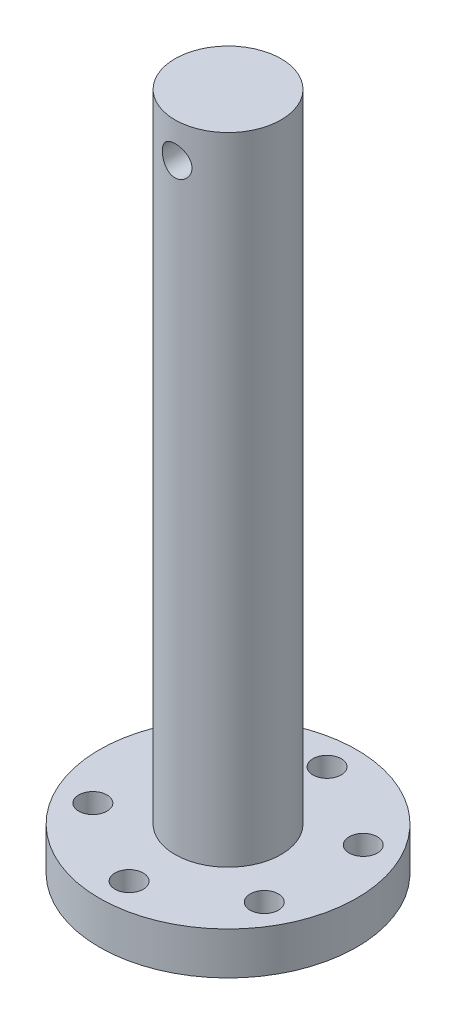
ISO-10303-21;
HEADER;
FILE_DESCRIPTION(('STEP AP214'),'2;1');
FILE_NAME('part.step','',(''),(''),'','','');
FILE_SCHEMA(('AUTOMOTIVE_DESIGN { 1 0 10303 214 1 1 1 1 }'));
ENDSEC;
DATA;
#1=APPLICATION_CONTEXT('core data for automotive mechanical design processes');
#2=APPLICATION_PROTOCOL_DEFINITION('international standard','automotive_design',2000,#1);
#3=PRODUCT_CONTEXT('',#1,'mechanical');
#4=PRODUCT('Part','Part','',(#3));
#5=PRODUCT_RELATED_PRODUCT_CATEGORY('part','',(#4));
#6=PRODUCT_DEFINITION_FORMATION('','',#4);
#7=PRODUCT_DEFINITION_CONTEXT('part definition',#1,'design');
#8=PRODUCT_DEFINITION('design','',#6,#7);
#9=PRODUCT_DEFINITION_SHAPE('','',#8);
#10=(LENGTH_UNIT() NAMED_UNIT(*) SI_UNIT(.MILLI.,.METRE.));
#11=(NAMED_UNIT(*) PLANE_ANGLE_UNIT() SI_UNIT($,.RADIAN.));
#12=(NAMED_UNIT(*) SI_UNIT($,.STERADIAN.) SOLID_ANGLE_UNIT());
#13=UNCERTAINTY_MEASURE_WITH_UNIT(LENGTH_MEASURE(1.E-05),#10,'distance_accuracy_value','');
#14=(GEOMETRIC_REPRESENTATION_CONTEXT(3) GLOBAL_UNCERTAINTY_ASSIGNED_CONTEXT((#13)) GLOBAL_UNIT_ASSIGNED_CONTEXT((#10,
#11,#12)) REPRESENTATION_CONTEXT('',''));
#15=CARTESIAN_POINT('',(0.,0.,0.));
#16=DIRECTION('',(0.,0.,1.));
#17=DIRECTION('',(1.,0.,0.));
#18=AXIS2_PLACEMENT_3D('',#15,#16,#17);
#19=CARTESIAN_POINT('',(0.,6.,0.));
#20=DIRECTION('',(0.,-1.,0.));
#21=DIRECTION('',(0.,0.,-1.));
#22=AXIS2_PLACEMENT_3D('',#19,#20,#21);
#23=CYLINDRICAL_SURFACE('',#22,18.2);
#24=CARTESIAN_POINT('',(0.,6.,0.));
#25=DIRECTION('',(0.,1.,0.));
#26=DIRECTION('',(0.,0.,1.));
#27=AXIS2_PLACEMENT_3D('',#24,#25,#26);
#28=CIRCLE('',#27,18.2);
#29=CARTESIAN_POINT('',(0.,6.,18.2));
#30=VERTEX_POINT('',#29);
#31=EDGE_CURVE('E44',#30,#30,#28,.T.);
#32=ORIENTED_EDGE('',*,*,#31,.F.);
#33=EDGE_LOOP('',(#32));
#34=FACE_BOUND('',#33,.T.);
#35=CARTESIAN_POINT('',(0.,0.,0.));
#36=DIRECTION('',(0.,1.,0.));
#37=DIRECTION('',(0.,0.,1.));
#38=AXIS2_PLACEMENT_3D('',#35,#36,#37);
#39=CIRCLE('',#38,18.2);
#40=CARTESIAN_POINT('',(0.,0.,18.2));
#41=VERTEX_POINT('',#40);
#42=EDGE_CURVE('E48',#41,#41,#39,.T.);
#43=ORIENTED_EDGE('',*,*,#42,.T.);
#44=EDGE_LOOP('',(#43));
#45=FACE_BOUND('',#44,.T.);
#46=ADVANCED_FACE('F32',(#34,#45),#23,.T.);
#47=CARTESIAN_POINT('',(0.,6.,0.));
#48=DIRECTION('',(0.,1.,0.));
#49=DIRECTION('',(0.,0.,1.));
#50=AXIS2_PLACEMENT_3D('',#47,#48,#49);
#51=PLANE('',#50);
#52=CARTESIAN_POINT('',(0.,6.,0.));
#53=DIRECTION('',(0.,1.,0.));
#54=DIRECTION('',(0.,0.,1.));
#55=AXIS2_PLACEMENT_3D('',#52,#53,#54);
#56=CIRCLE('',#55,7.5);
#57=CARTESIAN_POINT('',(0.,6.,7.5));
#58=VERTEX_POINT('',#57);
#59=EDGE_CURVE('E130',#58,#58,#56,.T.);
#60=ORIENTED_EDGE('',*,*,#59,.F.);
#61=EDGE_LOOP('',(#60));
#62=FACE_BOUND('',#61,.T.);
#63=CARTESIAN_POINT('',(12.1243556529821,6.,-7.00000000000014));
#64=DIRECTION('',(0.,1.,0.));
#65=DIRECTION('',(-0.866025403784433,0.,0.50000000000001));
#66=AXIS2_PLACEMENT_3D('',#63,#64,#65);
#67=CIRCLE('',#66,2.);
#68=CARTESIAN_POINT('',(10.3923048454132,6.,-6.00000000000012));
#69=VERTEX_POINT('',#68);
#70=EDGE_CURVE('E118',#69,#69,#67,.T.);
#71=ORIENTED_EDGE('',*,*,#70,.F.);
#72=EDGE_LOOP('',(#71));
#73=FACE_BOUND('',#72,.T.);
#74=CARTESIAN_POINT('',(12.1243556529822,6.,6.99999999999989));
#75=DIRECTION('',(0.,1.,0.));
#76=DIRECTION('',(-0.866025403784443,0.,-0.499999999999992));
#77=AXIS2_PLACEMENT_3D('',#74,#75,#76);
#78=CIRCLE('',#77,2.);
#79=CARTESIAN_POINT('',(10.3923048454133,6.,5.9999999999999));
#80=VERTEX_POINT('',#79);
#81=EDGE_CURVE('E121',#80,#80,#78,.T.);
#82=ORIENTED_EDGE('',*,*,#81,.F.);
#83=EDGE_LOOP('',(#82));
#84=FACE_BOUND('',#83,.T.);
#85=CARTESIAN_POINT('',(0.,6.,14.));
#86=DIRECTION('',(0.,1.,0.));
#87=DIRECTION('',(0.,0.,-1.));
#88=AXIS2_PLACEMENT_3D('',#85,#86,#87);
#89=CIRCLE('',#88,2.);
#90=CARTESIAN_POINT('',(0.,6.,12.));
#91=VERTEX_POINT('',#90);
#92=EDGE_CURVE('E125',#91,#91,#89,.T.);
#93=ORIENTED_EDGE('',*,*,#92,.F.);
#94=EDGE_LOOP('',(#93));
#95=FACE_BOUND('',#94,.T.);
#96=CARTESIAN_POINT('',(-12.1243556529821,6.,7.00000000000006));
#97=DIRECTION('',(0.,1.,0.));
#98=DIRECTION('',(0.866025403784436,0.,-0.500000000000004));
#99=AXIS2_PLACEMENT_3D('',#96,#97,#98);
#100=CIRCLE('',#99,2.);
#101=CARTESIAN_POINT('',(-10.3923048454132,6.,6.00000000000005));
#102=VERTEX_POINT('',#101);
#103=EDGE_CURVE('E117',#102,#102,#100,.T.);
#104=ORIENTED_EDGE('',*,*,#103,.F.);
#105=EDGE_LOOP('',(#104));
#106=FACE_BOUND('',#105,.T.);
#107=CARTESIAN_POINT('',(-12.1243556529822,6.,-6.99999999999997));
#108=DIRECTION('',(0.,1.,0.));
#109=DIRECTION('',(0.86602540378444,0.,0.499999999999998));
#110=AXIS2_PLACEMENT_3D('',#107,#108,#109);
#111=CIRCLE('',#110,2.);
#112=CARTESIAN_POINT('',(-10.3923048454133,6.,-5.99999999999998));
#113=VERTEX_POINT('',#112);
#114=EDGE_CURVE('E99',#113,#113,#111,.T.);
#115=ORIENTED_EDGE('',*,*,#114,.F.);
#116=EDGE_LOOP('',(#115));
#117=FACE_BOUND('',#116,.T.);
#118=CARTESIAN_POINT('',(0.,6.,-14.));
#119=DIRECTION('',(0.,1.,0.));
#120=DIRECTION('',(0.,0.,1.));
#121=AXIS2_PLACEMENT_3D('',#118,#119,#120);
#122=CIRCLE('',#121,2.);
#123=CARTESIAN_POINT('',(0.,6.,-12.));
#124=VERTEX_POINT('',#123);
#125=EDGE_CURVE('E91',#124,#124,#122,.T.);
#126=ORIENTED_EDGE('',*,*,#125,.F.);
#127=EDGE_LOOP('',(#126));
#128=FACE_BOUND('',#127,.T.);
#129=ORIENTED_EDGE('',*,*,#31,.T.);
#130=EDGE_LOOP('',(#129));
#131=FACE_BOUND('',#130,.T.);
#132=ADVANCED_FACE('F75',(#62,#73,#84,#95,#106,#117,#128,#131),#51,.T.);
#133=CARTESIAN_POINT('',(0.,0.,0.));
#134=DIRECTION('',(0.,1.,0.));
#135=DIRECTION('',(0.,0.,1.));
#136=AXIS2_PLACEMENT_3D('',#133,#134,#135);
#137=PLANE('',#136);
#138=CARTESIAN_POINT('',(12.1243556529821,0.,-7.00000000000014));
#139=DIRECTION('',(0.,1.,0.));
#140=DIRECTION('',(0.,0.,1.));
#141=AXIS2_PLACEMENT_3D('',#138,#139,#140);
#142=CIRCLE('',#141,2.);
#143=CARTESIAN_POINT('',(12.1243556529821,0.,-5.00000000000014));
#144=VERTEX_POINT('',#143);
#145=EDGE_CURVE('E54',#144,#144,#142,.T.);
#146=ORIENTED_EDGE('',*,*,#145,.T.);
#147=EDGE_LOOP('',(#146));
#148=FACE_BOUND('',#147,.T.);
#149=CARTESIAN_POINT('',(12.1243556529822,0.,6.99999999999989));
#150=DIRECTION('',(0.,1.,0.));
#151=DIRECTION('',(0.,0.,1.));
#152=AXIS2_PLACEMENT_3D('',#149,#150,#151);
#153=CIRCLE('',#152,2.);
#154=CARTESIAN_POINT('',(12.1243556529822,0.,8.99999999999989));
#155=VERTEX_POINT('',#154);
#156=EDGE_CURVE('E104',#155,#155,#153,.T.);
#157=ORIENTED_EDGE('',*,*,#156,.T.);
#158=EDGE_LOOP('',(#157));
#159=FACE_BOUND('',#158,.T.);
#160=CARTESIAN_POINT('',(0.,0.,14.));
#161=DIRECTION('',(0.,1.,0.));
#162=DIRECTION('',(0.,0.,1.));
#163=AXIS2_PLACEMENT_3D('',#160,#161,#162);
#164=CIRCLE('',#163,2.);
#165=CARTESIAN_POINT('',(0.,0.,16.));
#166=VERTEX_POINT('',#165);
#167=EDGE_CURVE('E102',#166,#166,#164,.T.);
#168=ORIENTED_EDGE('',*,*,#167,.T.);
#169=EDGE_LOOP('',(#168));
#170=FACE_BOUND('',#169,.T.);
#171=CARTESIAN_POINT('',(-12.1243556529821,0.,7.00000000000006));
#172=DIRECTION('',(0.,1.,0.));
#173=DIRECTION('',(0.,0.,1.));
#174=AXIS2_PLACEMENT_3D('',#171,#172,#173);
#175=CIRCLE('',#174,2.);
#176=CARTESIAN_POINT('',(-12.1243556529821,0.,9.00000000000006));
#177=VERTEX_POINT('',#176);
#178=EDGE_CURVE('E98',#177,#177,#175,.T.);
#179=ORIENTED_EDGE('',*,*,#178,.T.);
#180=EDGE_LOOP('',(#179));
#181=FACE_BOUND('',#180,.T.);
#182=CARTESIAN_POINT('',(-12.1243556529822,0.,-6.99999999999997));
#183=DIRECTION('',(0.,1.,0.));
#184=DIRECTION('',(0.,0.,1.));
#185=AXIS2_PLACEMENT_3D('',#182,#183,#184);
#186=CIRCLE('',#185,2.);
#187=CARTESIAN_POINT('',(-12.1243556529822,0.,-4.99999999999997));
#188=VERTEX_POINT('',#187);
#189=EDGE_CURVE('E95',#188,#188,#186,.T.);
#190=ORIENTED_EDGE('',*,*,#189,.T.);
#191=EDGE_LOOP('',(#190));
#192=FACE_BOUND('',#191,.T.);
#193=CARTESIAN_POINT('',(0.,0.,-14.));
#194=DIRECTION('',(0.,1.,0.));
#195=DIRECTION('',(0.,0.,1.));
#196=AXIS2_PLACEMENT_3D('',#193,#194,#195);
#197=CIRCLE('',#196,2.);
#198=CARTESIAN_POINT('',(0.,0.,-12.));
#199=VERTEX_POINT('',#198);
#200=EDGE_CURVE('E88',#199,#199,#197,.T.);
#201=ORIENTED_EDGE('',*,*,#200,.T.);
#202=EDGE_LOOP('',(#201));
#203=FACE_BOUND('',#202,.T.);
#204=ORIENTED_EDGE('',*,*,#42,.F.);
#205=EDGE_LOOP('',(#204));
#206=FACE_BOUND('',#205,.T.);
#207=ADVANCED_FACE('F80',(#148,#159,#170,#181,#192,#203,#206),#137,.F.);
#208=CARTESIAN_POINT('',(0.,-4.,-14.));
#209=DIRECTION('',(0.,1.,0.));
#210=DIRECTION('',(0.,0.,1.));
#211=AXIS2_PLACEMENT_3D('',#208,#209,#210);
#212=CYLINDRICAL_SURFACE('',#211,2.);
#213=ORIENTED_EDGE('',*,*,#125,.T.);
#214=EDGE_LOOP('',(#213));
#215=FACE_BOUND('',#214,.T.);
#216=ORIENTED_EDGE('',*,*,#200,.F.);
#217=EDGE_LOOP('',(#216));
#218=FACE_BOUND('',#217,.T.);
#219=ADVANCED_FACE('F154',(#215,#218),#212,.F.);
#220=CARTESIAN_POINT('',(-12.1243556529822,-4.,-6.99999999999997));
#221=DIRECTION('',(0.,1.,0.));
#222=DIRECTION('',(0.,0.,1.));
#223=AXIS2_PLACEMENT_3D('',#220,#221,#222);
#224=CYLINDRICAL_SURFACE('',#223,2.);
#225=ORIENTED_EDGE('',*,*,#114,.T.);
#226=EDGE_LOOP('',(#225));
#227=FACE_BOUND('',#226,.T.);
#228=ORIENTED_EDGE('',*,*,#189,.F.);
#229=EDGE_LOOP('',(#228));
#230=FACE_BOUND('',#229,.T.);
#231=ADVANCED_FACE('F150',(#227,#230),#224,.F.);
#232=CARTESIAN_POINT('',(-12.1243556529821,-4.,7.00000000000006));
#233=DIRECTION('',(0.,1.,0.));
#234=DIRECTION('',(0.,0.,1.));
#235=AXIS2_PLACEMENT_3D('',#232,#233,#234);
#236=CYLINDRICAL_SURFACE('',#235,2.);
#237=ORIENTED_EDGE('',*,*,#103,.T.);
#238=EDGE_LOOP('',(#237));
#239=FACE_BOUND('',#238,.T.);
#240=ORIENTED_EDGE('',*,*,#178,.F.);
#241=EDGE_LOOP('',(#240));
#242=FACE_BOUND('',#241,.T.);
#243=ADVANCED_FACE('F153',(#239,#242),#236,.F.);
#244=CARTESIAN_POINT('',(0.,-4.,14.));
#245=DIRECTION('',(0.,1.,0.));
#246=DIRECTION('',(0.,0.,1.));
#247=AXIS2_PLACEMENT_3D('',#244,#245,#246);
#248=CYLINDRICAL_SURFACE('',#247,2.);
#249=ORIENTED_EDGE('',*,*,#92,.T.);
#250=EDGE_LOOP('',(#249));
#251=FACE_BOUND('',#250,.T.);
#252=ORIENTED_EDGE('',*,*,#167,.F.);
#253=EDGE_LOOP('',(#252));
#254=FACE_BOUND('',#253,.T.);
#255=ADVANCED_FACE('F173',(#251,#254),#248,.F.);
#256=CARTESIAN_POINT('',(12.1243556529822,-4.,6.99999999999989));
#257=DIRECTION('',(0.,1.,0.));
#258=DIRECTION('',(0.,0.,1.));
#259=AXIS2_PLACEMENT_3D('',#256,#257,#258);
#260=CYLINDRICAL_SURFACE('',#259,2.);
#261=ORIENTED_EDGE('',*,*,#81,.T.);
#262=EDGE_LOOP('',(#261));
#263=FACE_BOUND('',#262,.T.);
#264=ORIENTED_EDGE('',*,*,#156,.F.);
#265=EDGE_LOOP('',(#264));
#266=FACE_BOUND('',#265,.T.);
#267=ADVANCED_FACE('F169',(#263,#266),#260,.F.);
#268=CARTESIAN_POINT('',(12.1243556529821,-4.,-7.00000000000014));
#269=DIRECTION('',(0.,1.,0.));
#270=DIRECTION('',(0.,0.,1.));
#271=AXIS2_PLACEMENT_3D('',#268,#269,#270);
#272=CYLINDRICAL_SURFACE('',#271,2.);
#273=ORIENTED_EDGE('',*,*,#70,.T.);
#274=EDGE_LOOP('',(#273));
#275=FACE_BOUND('',#274,.T.);
#276=ORIENTED_EDGE('',*,*,#145,.F.);
#277=EDGE_LOOP('',(#276));
#278=FACE_BOUND('',#277,.T.);
#279=ADVANCED_FACE('F71',(#275,#278),#272,.F.);
#280=CARTESIAN_POINT('',(0.,96.,0.));
#281=DIRECTION('',(0.,-1.,0.));
#282=DIRECTION('',(0.,0.,-1.));
#283=AXIS2_PLACEMENT_3D('',#280,#281,#282);
#284=CYLINDRICAL_SURFACE('',#283,7.5);
#285=CARTESIAN_POINT('',(-2.1,91.,7.2));
#286=CARTESIAN_POINT('',(-2.09999769142372,91.1154488948287,7.2000017509261));
#287=CARTESIAN_POINT('',(-2.09044725800801,91.2309214246793,7.20280713265303));
#288=CARTESIAN_POINT('',(-2.05258019102825,91.4585157124498,7.21368770991474));
#289=CARTESIAN_POINT('',(-2.02425538445371,91.570635988814,7.22176520052276));
#290=CARTESIAN_POINT('',(-1.94985652031882,91.7881997601164,7.24220502233453));
#291=CARTESIAN_POINT('',(-1.90380916683966,91.8936530238129,7.25456090412264));
#292=CARTESIAN_POINT('',(-1.79535769220004,92.0953579239335,7.28215690109494));
#293=CARTESIAN_POINT('',(-1.73295183131604,92.1916085801758,7.29739732300137));
#294=CARTESIAN_POINT('',(-1.59171413202465,92.3748294758362,7.32951618449188));
#295=CARTESIAN_POINT('',(-1.5125114960631,92.4615084459222,7.34642599336529));
#296=CARTESIAN_POINT('',(-1.34072490285874,92.6205431520083,7.37970866753021));
#297=CARTESIAN_POINT('',(-1.24813943745966,92.6928972715119,7.39608147204939));
#298=CARTESIAN_POINT('',(-1.05017536418179,92.822462348375,7.42679785762245));
#299=CARTESIAN_POINT('',(-0.94459839021223,92.8793808646098,7.44110013563313));
#300=CARTESIAN_POINT('',(-0.72490474677134,92.9745469082315,7.46570231446394));
#301=CARTESIAN_POINT('',(-0.610789675797217,93.0127979204993,7.4760029622418));
#302=CARTESIAN_POINT('',(-0.38030223637302,93.0685922752581,7.49121941354851));
#303=CARTESIAN_POINT('',(-0.264058623362749,93.0866317606157,7.49626401123117));
#304=CARTESIAN_POINT('',(-0.0300927460087994,93.1030549787338,7.50085154395726));
#305=CARTESIAN_POINT('',(0.0876292425050892,93.1014423252485,7.50039549049382));
#306=CARTESIAN_POINT('',(0.317746311518644,93.0789501166803,7.49412619131461));
#307=CARTESIAN_POINT('',(0.430198522887047,93.0586070603331,7.48846212582118));
#308=CARTESIAN_POINT('',(0.650024177765272,93.000101960692,7.47259127690994));
#309=CARTESIAN_POINT('',(0.757397317354188,92.9619388525654,7.4623842220287));
#310=CARTESIAN_POINT('',(0.965349801263534,92.8684846064445,7.43835884069074));
#311=CARTESIAN_POINT('',(1.06584470618676,92.8130155506946,7.42450324668395));
#312=CARTESIAN_POINT('',(1.25627862457919,92.6866620400625,7.39466485562083));
#313=CARTESIAN_POINT('',(1.34621539544037,92.6157743192567,7.37868160817165));
#314=CARTESIAN_POINT('',(1.51618305590154,92.4577724564465,7.34567522057905));
#315=CARTESIAN_POINT('',(1.59577717509012,92.3701914158966,7.32863518998309));
#316=CARTESIAN_POINT('',(1.73926156835205,92.182751313548,7.29591665217892));
#317=CARTESIAN_POINT('',(1.80315067068667,92.082891336461,7.28023824661686));
#318=CARTESIAN_POINT('',(1.9137903023159,91.872703330004,7.25194501002576));
#319=CARTESIAN_POINT('',(1.96041048527216,91.7623032942785,7.23935371206725));
#320=CARTESIAN_POINT('',(2.03427979371574,91.5347894472161,7.21894665875122));
#321=CARTESIAN_POINT('',(2.0615342965447,91.4176775093668,7.21112957780356));
#322=CARTESIAN_POINT('',(2.0951213370356,91.1841773460367,7.20144181427927));
#323=CARTESIAN_POINT('',(2.10211023295227,91.06789117268,7.19938465899453));
#324=CARTESIAN_POINT('',(2.09678562260949,90.8358093209789,7.20093733719562));
#325=CARTESIAN_POINT('',(2.08447441367737,90.7200135859017,7.20454649620961));
#326=CARTESIAN_POINT('',(2.04148011473317,90.4948078880388,7.21684386770043));
#327=CARTESIAN_POINT('',(2.01120230768185,90.3853138225628,7.22541993924817));
#328=CARTESIAN_POINT('',(1.9335954321454,90.172961240714,7.24657269498035));
#329=CARTESIAN_POINT('',(1.88626397295672,90.0701036570757,7.25914994004911));
#330=CARTESIAN_POINT('',(1.77459509136293,89.8712273023822,7.28726240690147));
#331=CARTESIAN_POINT('',(1.70987813502038,89.775430833993,7.30286116048027));
#332=CARTESIAN_POINT('',(1.56573803326782,89.5958168535615,7.33511474861878));
#333=CARTESIAN_POINT('',(1.48631183008103,89.51200183867,7.35176980228926));
#334=CARTESIAN_POINT('',(1.31195238316686,89.3559491634262,7.38490975407122));
#335=CARTESIAN_POINT('',(1.21660153256645,89.2841722305027,7.4013718288206));
#336=CARTESIAN_POINT('',(1.01482822512429,89.1576370443006,7.43172364179826));
#337=CARTESIAN_POINT('',(0.908406353625243,89.1028778918743,7.44561351591507));
#338=CARTESIAN_POINT('',(0.688255620931209,89.0124507648858,7.46916678636433));
#339=CARTESIAN_POINT('',(0.574589642969943,88.9766384036022,7.47886204186584));
#340=CARTESIAN_POINT('',(0.342537614831892,88.9247182114588,7.4930742926061));
#341=CARTESIAN_POINT('',(0.224152734238753,88.9086055289913,7.49759256280785));
#342=CARTESIAN_POINT('',(-0.00969112124073842,88.89687160528,7.50087475153958));
#343=CARTESIAN_POINT('',(-0.125114144971023,88.9005776959546,7.49982757425403));
#344=CARTESIAN_POINT('',(-0.353626881036683,88.9267963886149,7.49253071356722));
#345=CARTESIAN_POINT('',(-0.466716697254863,88.9493081514446,7.48628126230442));
#346=CARTESIAN_POINT('',(-0.686456269375156,89.0121038604166,7.46932613881606));
#347=CARTESIAN_POINT('',(-0.793151611784471,89.052239045683,7.4586578085919));
#348=CARTESIAN_POINT('',(-0.998353701041731,89.1490100128,7.43397489084362));
#349=CARTESIAN_POINT('',(-1.09685921135808,89.205648280554,7.41995979924538));
#350=CARTESIAN_POINT('',(-1.28596610763477,89.3357169982286,7.38956927564246));
#351=CARTESIAN_POINT('',(-1.37625788128738,89.4095843530502,7.37313745973981));
#352=CARTESIAN_POINT('',(-1.54339107601342,89.5712021784605,7.3399740390093));
#353=CARTESIAN_POINT('',(-1.62022882700921,89.658956424818,7.32324235374892));
#354=CARTESIAN_POINT('',(-1.76018100811381,89.8484871222819,7.29088892650894));
#355=CARTESIAN_POINT('',(-1.82290552428643,89.9505586273202,7.27530525828303));
#356=CARTESIAN_POINT('',(-1.93021956053795,90.1642219912406,7.24757503896698));
#357=CARTESIAN_POINT('',(-1.97481976673699,90.2758081931487,7.23542646383001));
#358=CARTESIAN_POINT('',(-2.03947300884321,90.4889828496491,7.2174445712127));
#359=CARTESIAN_POINT('',(-2.0621139131252,90.5897382388729,7.21095909202013));
#360=CARTESIAN_POINT('',(-2.09237736458972,90.7936563570857,7.20223632826998));
#361=CARTESIAN_POINT('',(-2.10000206326628,90.8968187390619,7.19999843512782));
#362=CARTESIAN_POINT('',(-2.1,91.,7.2));
#363=B_SPLINE_CURVE_WITH_KNOTS('',3,(#285,#286,#287,#288,#289,#290,#291,#292,#293,#294,#295,
#296,#297,#298,#299,#300,#301,#302,#303,#304,#305,#306,#307,#308,#309,#310,#311,#312,#313,#314,
#315,#316,#317,#318,#319,#320,#321,#322,#323,#324,#325,#326,#327,#328,#329,#330,#331,#332,#333,
#334,#335,#336,#337,#338,#339,#340,#341,#342,#343,#344,#345,#346,#347,#348,#349,#350,#351,#352,
#353,#354,#355,#356,#357,#358,#359,#360,#361,#362),.UNSPECIFIED.,.T.,.F.,(4,2,2,2,2,2,2,2,2,2,2,
2,2,2,2,2,2,2,2,2,2,2,2,2,2,2,2,2,2,2,2,2,2,2,2,2,2,2,4),(0.,0.345966820679499,
0.692084349409691,1.03768238213023,1.38331718404492,1.73757082880148,2.0918644267682,
2.4524638141162,2.8129958583931,3.16446935825172,3.51587822801513,3.85752460211595,
4.19919139381879,4.54449343533441,4.88986868878043,5.24690042870957,5.60395879841152,
5.96365984094946,6.3232609648655,6.67107770948495,7.01885305597465,7.35906666926105,
7.69932799470609,8.04772451120094,8.39619353426629,8.75590447674844,9.11559641039045,
9.47250627059275,9.82932821384837,10.1741178008124,10.5188920032276,10.8608102624593,
11.202780052397,11.5546053491272,11.9065264700836,12.2672217164641,12.6277039867531,
12.9369525819906,13.2461568654394),.UNSPECIFIED.);
#364=CARTESIAN_POINT('',(-2.1,91.,7.2));
#365=VERTEX_POINT('',#364);
#366=EDGE_CURVE('E35',#365,#365,#363,.T.);
#367=ORIENTED_EDGE('',*,*,#366,.T.);
#368=EDGE_LOOP('',(#367));
#369=FACE_BOUND('',#368,.T.);
#370=CARTESIAN_POINT('',(0.,93.1,-7.5));
#371=CARTESIAN_POINT('',(-0.115549071859457,93.0999977340684,-7.49999850044544));
#372=CARTESIAN_POINT('',(-0.231121705110066,93.0904312983852,-7.4973036885812));
#373=CARTESIAN_POINT('',(-0.458923495634753,93.0524949173941,-7.4868158263674));
#374=CARTESIAN_POINT('',(-0.571151263080416,93.0241172665758,-7.47902068682222));
#375=CARTESIAN_POINT('',(-0.78894323819551,92.9495640201166,-7.45919014801396));
#376=CARTESIAN_POINT('',(-0.894516296930388,92.9034126714867,-7.4471605273756));
#377=CARTESIAN_POINT('',(-1.09642476541402,92.7947157318247,-7.420124150391));
#378=CARTESIAN_POINT('',(-1.19275931288065,92.7321686125134,-7.40511711654645));
#379=CARTESIAN_POINT('',(-1.37589761639297,92.5907831413099,-7.37331332850794));
#380=CARTESIAN_POINT('',(-1.4624339548342,92.5116058280896,-7.35648356700851));
#381=CARTESIAN_POINT('',(-1.6211899497533,92.3399312338879,-7.32313712362263));
#382=CARTESIAN_POINT('',(-1.69340755595237,92.2474320486357,-7.30662048687785));
#383=CARTESIAN_POINT('',(-1.8228195441851,92.0495555118287,-7.27542837897222));
#384=CARTESIAN_POINT('',(-1.87969906189859,91.9439651052421,-7.26079431852521));
#385=CARTESIAN_POINT('',(-1.97478943248914,91.7242430501572,-7.23551274440862));
#386=CARTESIAN_POINT('',(-2.0130041235612,91.6101131632707,-7.22486441122792));
#387=CARTESIAN_POINT('',(-2.06873752873865,91.3795301714627,-7.20910195955085));
#388=CARTESIAN_POINT('',(-2.08674433574884,91.2632041712619,-7.20385758469793));
#389=CARTESIAN_POINT('',(-2.1030735498869,91.0290732443517,-7.19910829329381));
#390=CARTESIAN_POINT('',(-2.1014000478612,90.9112686300798,-7.1996021839581));
#391=CARTESIAN_POINT('',(-2.07880203719545,90.6813944387991,-7.20615747477844));
#392=CARTESIAN_POINT('',(-2.05847601372623,90.5692602936321,-7.21204577982249));
#393=CARTESIAN_POINT('',(-2.00011173806164,90.3500614648778,-7.22844816907821));
#394=CARTESIAN_POINT('',(-1.96207194147723,90.2429972242109,-7.23896265662278));
#395=CARTESIAN_POINT('',(-1.86889065894204,90.0354547701562,-7.2635793822286));
#396=CARTESIAN_POINT('',(-1.81354549979216,89.9350732369256,-7.27772396889439));
#397=CARTESIAN_POINT('',(-1.68746638599935,89.7448156066742,-7.30798533076004));
#398=CARTESIAN_POINT('',(-1.61672912560209,89.654941772771,-7.32410252929097));
#399=CARTESIAN_POINT('',(-1.45884755286451,89.4848406076291,-7.35720651544555));
#400=CARTESIAN_POINT('',(-1.37120287335207,89.4050790082679,-7.37420368441479));
#401=CARTESIAN_POINT('',(-1.18357169751818,89.2612853049701,-7.40663279030198));
#402=CARTESIAN_POINT('',(-1.08358461129693,89.1972539532914,-7.42206465234251));
#403=CARTESIAN_POINT('',(-0.873337450332615,89.0865038081176,-7.44973605200326));
#404=CARTESIAN_POINT('',(-0.763026733669791,89.0398766273177,-7.46195859911618));
#405=CARTESIAN_POINT('',(-0.535710183719857,88.9659673387535,-7.48171171416257));
#406=CARTESIAN_POINT('',(-0.418705976174605,88.938680554894,-7.48924341618883));
#407=CARTESIAN_POINT('',(-0.185292401498553,88.9049748769127,-7.498591647067));
#408=CARTESIAN_POINT('',(-0.0689811489871938,88.8979235914578,-7.50058131296794));
#409=CARTESIAN_POINT('',(0.163164639318414,88.9031325567059,-7.49912299982235));
#410=CARTESIAN_POINT('',(0.278999228327222,88.9153905896642,-7.49567564523712));
#411=CARTESIAN_POINT('',(0.50459626873241,88.9583541024876,-7.48384311833654));
#412=CARTESIAN_POINT('',(0.614432648474325,88.9887003524127,-7.47555416236048));
#413=CARTESIAN_POINT('',(0.827440079594201,89.0665559249828,-7.4549851125704));
#414=CARTESIAN_POINT('',(0.930610372215041,89.1140671973673,-7.44270456537565));
#415=CARTESIAN_POINT('',(1.12976408663136,89.226033514973,-7.41511700690706));
#416=CARTESIAN_POINT('',(1.22555065053477,89.2908239918027,-7.39975176074413));
#417=CARTESIAN_POINT('',(1.40511158541057,89.4350935103366,-7.36776719837964));
#418=CARTESIAN_POINT('',(1.48888332632155,89.5145757594014,-7.35114760881206));
#419=CARTESIAN_POINT('',(1.64474908309543,89.6889334558994,-7.31787944351906));
#420=CARTESIAN_POINT('',(1.71639518266252,89.7842130475328,-7.30124626249002));
#421=CARTESIAN_POINT('',(1.84269980125679,89.9857997561693,-7.27039890541724));
#422=CARTESIAN_POINT('',(1.8973589550336,90.0921064609252,-7.25618463899512));
#423=CARTESIAN_POINT('',(1.98773352270873,90.3122566986658,-7.23195038062151));
#424=CARTESIAN_POINT('',(2.0235528782643,90.4260548958874,-7.221907440962));
#425=CARTESIAN_POINT('',(2.07544269963815,90.6583932173263,-7.20716859474244));
#426=CARTESIAN_POINT('',(2.09151885593221,90.7769319650244,-7.20247114750862));
#427=CARTESIAN_POINT('',(2.103114655158,91.0107756368505,-7.19909300510936));
#428=CARTESIAN_POINT('',(2.09935796340977,91.1260421256435,-7.20020048759655));
#429=CARTESIAN_POINT('',(2.07309224060162,91.3542278974938,-7.20780629176382));
#430=CARTESIAN_POINT('',(2.05058378962984,91.4671472530492,-7.21430444668271));
#431=CARTESIAN_POINT('',(1.98789228158042,91.6864176936546,-7.23182691657987));
#432=CARTESIAN_POINT('',(1.94787737568999,91.7928205480617,-7.24280810607178));
#433=CARTESIAN_POINT('',(1.85143886377055,91.9974856029703,-7.26805665519028));
#434=CARTESIAN_POINT('',(1.79501245122782,92.0957464074128,-7.28232457679045));
#435=CARTESIAN_POINT('',(1.66522213518896,92.2847555918117,-7.31311239075332));
#436=CARTESIAN_POINT('',(1.5913715580402,92.3751604077316,-7.32968998213804));
#437=CARTESIAN_POINT('',(1.42973554613915,92.542529066278,-7.36292421204913));
#438=CARTESIAN_POINT('',(1.34194664686121,92.6194895571519,-7.37958086922697));
#439=CARTESIAN_POINT('',(1.15235163570582,92.759635179466,-7.4115813836939));
#440=CARTESIAN_POINT('',(1.05025658819516,92.8224398452787,-7.42688347042849));
#441=CARTESIAN_POINT('',(0.836529392791815,92.929897916664,-7.453978020383));
#442=CARTESIAN_POINT('',(0.724902784475292,92.9745617796203,-7.46577250453007));
#443=CARTESIAN_POINT('',(0.511578272572161,93.0393389906795,-7.48318647397412));
#444=CARTESIAN_POINT('',(0.41070827449254,93.0620307555927,-7.48944328125703));
#445=CARTESIAN_POINT('',(0.206564929983072,93.0923613529761,-7.49785046352107));
#446=CARTESIAN_POINT('',(0.103291878908552,93.1000020255666,-7.50000134048509));
#447=CARTESIAN_POINT('',(0.,93.1,-7.5));
#448=B_SPLINE_CURVE_WITH_KNOTS('',3,(#370,#371,#372,#373,#374,#375,#376,#377,#378,#379,#380,
#381,#382,#383,#384,#385,#386,#387,#388,#389,#390,#391,#392,#393,#394,#395,#396,#397,#398,#399,
#400,#401,#402,#403,#404,#405,#406,#407,#408,#409,#410,#411,#412,#413,#414,#415,#416,#417,#418,
#419,#420,#421,#422,#423,#424,#425,#426,#427,#428,#429,#430,#431,#432,#433,#434,#435,#436,#437,
#438,#439,#440,#441,#442,#443,#444,#445,#446,#447),.UNSPECIFIED.,.T.,.F.,(4,2,2,2,2,2,2,2,2,2,2,
2,2,2,2,2,2,2,2,2,2,2,2,2,2,2,2,2,2,2,2,2,2,2,2,2,2,2,4),(0.,0.346268182086731,0.69267829137671,
1.03861748991142,1.38458894553263,1.73844946991324,2.09236062654247,2.45306282264887,
2.81369081346571,3.16540713829204,3.51705035491519,3.85779089256617,4.19856114350907,
4.54350342442874,4.88851986168956,5.24599927407037,5.60349577863915,5.96284840125166,
6.32211411040289,6.67002301614662,7.01789196621457,7.35907226789239,7.70029133572957,
8.04868889915358,8.39716261126664,8.75655041081183,9.11592477953098,9.47329506480396,
9.83056232297607,10.1748857034315,10.5191984325936,10.8602742217547,11.2014083722409,
11.5535216990377,11.9057226849498,12.2664877844677,12.6270446224261,12.936619283113,
13.2461560933912),.UNSPECIFIED.);
#449=CARTESIAN_POINT('',(0.,93.1,-7.5));
#450=VERTEX_POINT('',#449);
#451=EDGE_CURVE('E10',#450,#450,#448,.T.);
#452=ORIENTED_EDGE('',*,*,#451,.T.);
#453=EDGE_LOOP('',(#452));
#454=FACE_BOUND('',#453,.T.);
#455=CARTESIAN_POINT('',(0.,96.,0.));
#456=DIRECTION('',(0.,1.,0.));
#457=DIRECTION('',(0.,0.,1.));
#458=AXIS2_PLACEMENT_3D('',#455,#456,#457);
#459=CIRCLE('',#458,7.5);
#460=CARTESIAN_POINT('',(0.,96.,7.5));
#461=VERTEX_POINT('',#460);
#462=EDGE_CURVE('E122',#461,#461,#459,.T.);
#463=ORIENTED_EDGE('',*,*,#462,.F.);
#464=EDGE_LOOP('',(#463));
#465=FACE_BOUND('',#464,.T.);
#466=ORIENTED_EDGE('',*,*,#59,.T.);
#467=EDGE_LOOP('',(#466));
#468=FACE_BOUND('',#467,.T.);
#469=ADVANCED_FACE('F56',(#369,#454,#465,#468),#284,.T.);
#470=CARTESIAN_POINT('',(0.,96.,0.));
#471=DIRECTION('',(0.,1.,0.));
#472=DIRECTION('',(0.,0.,1.));
#473=AXIS2_PLACEMENT_3D('',#470,#471,#472);
#474=PLANE('',#473);
#475=ORIENTED_EDGE('',*,*,#462,.T.);
#476=EDGE_LOOP('',(#475));
#477=FACE_BOUND('',#476,.T.);
#478=ADVANCED_FACE('F63',(#477),#474,.T.);
#479=CARTESIAN_POINT('',(0.,91.,18.2));
#480=DIRECTION('',(0.,0.,-1.));
#481=DIRECTION('',(-1.,0.,0.));
#482=AXIS2_PLACEMENT_3D('',#479,#480,#481);
#483=CYLINDRICAL_SURFACE('',#482,2.1);
#484=ORIENTED_EDGE('',*,*,#366,.F.);
#485=EDGE_LOOP('',(#484));
#486=FACE_BOUND('',#485,.T.);
#487=ORIENTED_EDGE('',*,*,#451,.F.);
#488=EDGE_LOOP('',(#487));
#489=FACE_BOUND('',#488,.T.);
#490=ADVANCED_FACE('F60',(#486,#489),#483,.F.);
#491=CLOSED_SHELL('',(#46,#132,#207,#219,#231,#243,#255,#267,#279,#469,#478,#490));
#492=MANIFOLD_SOLID_BREP('B2',#491);
#493=ADVANCED_BREP_SHAPE_REPRESENTATION('',(#18,#492),#14);
#494=SHAPE_DEFINITION_REPRESENTATION(#9,#493);
ENDSEC;
END-ISO-10303-21;
